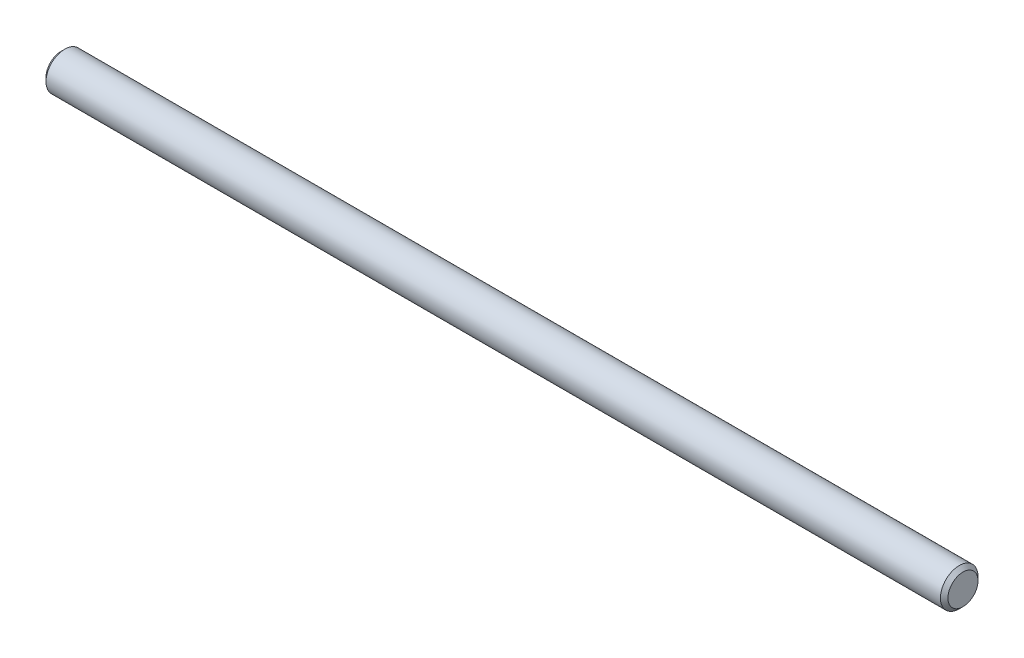
ISO-10303-21;
HEADER;
FILE_DESCRIPTION(('STEP AP214'),'2;1');
FILE_NAME('part.step','',(''),(''),'','','');
FILE_SCHEMA(('AUTOMOTIVE_DESIGN { 1 0 10303 214 1 1 1 1 }'));
ENDSEC;
DATA;
#1=APPLICATION_CONTEXT('core data for automotive mechanical design processes');
#2=APPLICATION_PROTOCOL_DEFINITION('international standard','automotive_design',2000,#1);
#3=PRODUCT_CONTEXT('',#1,'mechanical');
#4=PRODUCT('Part','Part','',(#3));
#5=PRODUCT_RELATED_PRODUCT_CATEGORY('part','',(#4));
#6=PRODUCT_DEFINITION_FORMATION('','',#4);
#7=PRODUCT_DEFINITION_CONTEXT('part definition',#1,'design');
#8=PRODUCT_DEFINITION('design','',#6,#7);
#9=PRODUCT_DEFINITION_SHAPE('','',#8);
#10=(LENGTH_UNIT() NAMED_UNIT(*) SI_UNIT(.MILLI.,.METRE.));
#11=(NAMED_UNIT(*) PLANE_ANGLE_UNIT() SI_UNIT($,.RADIAN.));
#12=(NAMED_UNIT(*) SI_UNIT($,.STERADIAN.) SOLID_ANGLE_UNIT());
#13=UNCERTAINTY_MEASURE_WITH_UNIT(LENGTH_MEASURE(1.E-05),#10,'distance_accuracy_value','');
#14=(GEOMETRIC_REPRESENTATION_CONTEXT(3) GLOBAL_UNCERTAINTY_ASSIGNED_CONTEXT((#13)) GLOBAL_UNIT_ASSIGNED_CONTEXT((#10,
#11,#12)) REPRESENTATION_CONTEXT('',''));
#15=CARTESIAN_POINT('',(0.,0.,0.));
#16=DIRECTION('',(0.,0.,1.));
#17=DIRECTION('',(1.,0.,0.));
#18=AXIS2_PLACEMENT_3D('',#15,#16,#17);
#19=CARTESIAN_POINT('',(-76.2,0.,0.));
#20=DIRECTION('',(1.,0.,0.));
#21=DIRECTION('',(0.,0.,-1.));
#22=AXIS2_PLACEMENT_3D('',#19,#20,#21);
#23=CYLINDRICAL_SURFACE('',#22,3.175);
#24=CARTESIAN_POINT('',(75.5650000000001,0.,0.));
#25=DIRECTION('',(1.,0.,0.));
#26=DIRECTION('',(0.,0.,-1.));
#27=AXIS2_PLACEMENT_3D('',#24,#25,#26);
#28=CIRCLE('',#27,3.175);
#29=CARTESIAN_POINT('',(75.5650000000001,0.,-3.175));
#30=VERTEX_POINT('',#29);
#31=EDGE_CURVE('E37',#30,#30,#28,.F.);
#32=ORIENTED_EDGE('',*,*,#31,.T.);
#33=EDGE_LOOP('',(#32));
#34=FACE_BOUND('',#33,.T.);
#35=CARTESIAN_POINT('',(-75.5650000000001,0.,0.));
#36=DIRECTION('',(1.,0.,0.));
#37=DIRECTION('',(0.,0.,-1.));
#38=AXIS2_PLACEMENT_3D('',#35,#36,#37);
#39=CIRCLE('',#38,3.175);
#40=CARTESIAN_POINT('',(-75.5650000000001,0.,-3.175));
#41=VERTEX_POINT('',#40);
#42=EDGE_CURVE('E41',#41,#41,#39,.T.);
#43=ORIENTED_EDGE('',*,*,#42,.T.);
#44=EDGE_LOOP('',(#43));
#45=FACE_BOUND('',#44,.T.);
#46=ADVANCED_FACE('F30',(#34,#45),#23,.T.);
#47=CARTESIAN_POINT('',(-76.2,0.,0.));
#48=DIRECTION('',(1.,0.,0.));
#49=DIRECTION('',(0.,0.,-1.));
#50=AXIS2_PLACEMENT_3D('',#47,#48,#49);
#51=PLANE('',#50);
#52=CARTESIAN_POINT('',(-76.2,0.,0.));
#53=DIRECTION('',(1.,0.,0.));
#54=DIRECTION('',(0.,0.,-1.));
#55=AXIS2_PLACEMENT_3D('',#52,#53,#54);
#56=CIRCLE('',#55,2.54);
#57=CARTESIAN_POINT('',(-76.2,0.,-2.54));
#58=VERTEX_POINT('',#57);
#59=EDGE_CURVE('E10',#58,#58,#56,.F.);
#60=ORIENTED_EDGE('',*,*,#59,.T.);
#61=EDGE_LOOP('',(#60));
#62=FACE_BOUND('',#61,.T.);
#63=ADVANCED_FACE('F61',(#62),#51,.F.);
#64=CARTESIAN_POINT('',(76.2,0.,0.));
#65=DIRECTION('',(1.,0.,0.));
#66=DIRECTION('',(0.,0.,-1.));
#67=AXIS2_PLACEMENT_3D('',#64,#65,#66);
#68=PLANE('',#67);
#69=CARTESIAN_POINT('',(76.2,0.,0.));
#70=DIRECTION('',(1.,0.,0.));
#71=DIRECTION('',(0.,0.,-1.));
#72=AXIS2_PLACEMENT_3D('',#69,#70,#71);
#73=CIRCLE('',#72,2.54);
#74=CARTESIAN_POINT('',(76.2,0.,-2.54));
#75=VERTEX_POINT('',#74);
#76=EDGE_CURVE('E45',#75,#75,#73,.T.);
#77=ORIENTED_EDGE('',*,*,#76,.T.);
#78=EDGE_LOOP('',(#77));
#79=FACE_BOUND('',#78,.T.);
#80=ADVANCED_FACE('F51',(#79),#68,.T.);
#81=CARTESIAN_POINT('',(76.2,0.,0.));
#82=DIRECTION('',(-1.,0.,0.));
#83=DIRECTION('',(0.,0.,1.));
#84=AXIS2_PLACEMENT_3D('',#81,#82,#83);
#85=CONICAL_SURFACE('',#84,2.54,0.785398163397451);
#86=ORIENTED_EDGE('',*,*,#31,.F.);
#87=EDGE_LOOP('',(#86));
#88=FACE_BOUND('',#87,.T.);
#89=ORIENTED_EDGE('',*,*,#76,.F.);
#90=EDGE_LOOP('',(#89));
#91=FACE_BOUND('',#90,.T.);
#92=ADVANCED_FACE('F53',(#88,#91),#85,.T.);
#93=CARTESIAN_POINT('',(-75.5650000000001,0.,0.));
#94=DIRECTION('',(1.,0.,0.));
#95=DIRECTION('',(0.,0.,-1.));
#96=AXIS2_PLACEMENT_3D('',#93,#94,#95);
#97=CONICAL_SURFACE('',#96,3.175,0.785398163397451);
#98=ORIENTED_EDGE('',*,*,#59,.F.);
#99=EDGE_LOOP('',(#98));
#100=FACE_BOUND('',#99,.T.);
#101=ORIENTED_EDGE('',*,*,#42,.F.);
#102=EDGE_LOOP('',(#101));
#103=FACE_BOUND('',#102,.T.);
#104=ADVANCED_FACE('F32',(#100,#103),#97,.T.);
#105=CLOSED_SHELL('',(#46,#63,#80,#92,#104));
#106=MANIFOLD_SOLID_BREP('B2',#105);
#107=ADVANCED_BREP_SHAPE_REPRESENTATION('',(#18,#106),#14);
#108=SHAPE_DEFINITION_REPRESENTATION(#9,#107);
ENDSEC;
END-ISO-10303-21;
